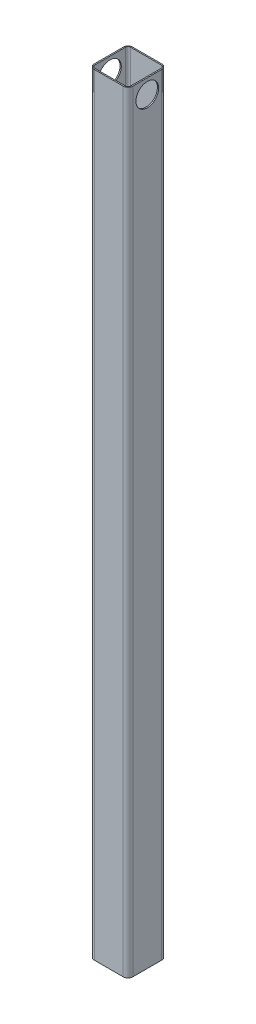
ISO-10303-21;
HEADER;
FILE_DESCRIPTION(('STEP AP214'),'2;1');
FILE_NAME('part.step','',(''),(''),'','','');
FILE_SCHEMA(('AUTOMOTIVE_DESIGN { 1 0 10303 214 1 1 1 1 }'));
ENDSEC;
DATA;
#1=APPLICATION_CONTEXT('core data for automotive mechanical design processes');
#2=APPLICATION_PROTOCOL_DEFINITION('international standard','automotive_design',2000,#1);
#3=PRODUCT_CONTEXT('',#1,'mechanical');
#4=PRODUCT('Part','Part','',(#3));
#5=PRODUCT_RELATED_PRODUCT_CATEGORY('part','',(#4));
#6=PRODUCT_DEFINITION_FORMATION('','',#4);
#7=PRODUCT_DEFINITION_CONTEXT('part definition',#1,'design');
#8=PRODUCT_DEFINITION('design','',#6,#7);
#9=PRODUCT_DEFINITION_SHAPE('','',#8);
#10=(LENGTH_UNIT() NAMED_UNIT(*) SI_UNIT(.MILLI.,.METRE.));
#11=(NAMED_UNIT(*) PLANE_ANGLE_UNIT() SI_UNIT($,.RADIAN.));
#12=(NAMED_UNIT(*) SI_UNIT($,.STERADIAN.) SOLID_ANGLE_UNIT());
#13=UNCERTAINTY_MEASURE_WITH_UNIT(LENGTH_MEASURE(1.E-05),#10,'distance_accuracy_value','');
#14=(GEOMETRIC_REPRESENTATION_CONTEXT(3) GLOBAL_UNCERTAINTY_ASSIGNED_CONTEXT((#13)) GLOBAL_UNIT_ASSIGNED_CONTEXT((#10,
#11,#12)) REPRESENTATION_CONTEXT('',''));
#15=CARTESIAN_POINT('',(0.,0.,0.));
#16=DIRECTION('',(0.,0.,1.));
#17=DIRECTION('',(1.,0.,0.));
#18=AXIS2_PLACEMENT_3D('',#15,#16,#17);
#19=CARTESIAN_POINT('',(28.575,762.,-28.575));
#20=DIRECTION('',(0.,1.,0.));
#21=DIRECTION('',(0.,0.,1.));
#22=AXIS2_PLACEMENT_3D('',#19,#20,#21);
#23=PLANE('',#22);
#24=CARTESIAN_POINT('',(28.575,762.,-28.575));
#25=DIRECTION('',(0.,1.,0.));
#26=DIRECTION('',(0.,0.,1.));
#27=AXIS2_PLACEMENT_3D('',#24,#25,#26);
#28=CIRCLE('',#27,9.525);
#29=CARTESIAN_POINT('',(38.1,762.,-28.575));
#30=VERTEX_POINT('',#29);
#31=CARTESIAN_POINT('',(28.575,762.,-38.1));
#32=VERTEX_POINT('',#31);
#33=EDGE_CURVE('E243',#30,#32,#28,.T.);
#34=ORIENTED_EDGE('',*,*,#33,.T.);
#35=DIRECTION('',(-1.,0.,0.));
#36=VECTOR('',#35,1.);
#37=CARTESIAN_POINT('',(28.575,762.,-38.1));
#38=LINE('',#37,#36);
#39=CARTESIAN_POINT('',(-28.575,762.,-38.1));
#40=VERTEX_POINT('',#39);
#41=EDGE_CURVE('E246',#32,#40,#38,.T.);
#42=ORIENTED_EDGE('',*,*,#41,.T.);
#43=CARTESIAN_POINT('',(-28.575,762.,-28.575));
#44=DIRECTION('',(0.,1.,0.));
#45=DIRECTION('',(0.,0.,1.));
#46=AXIS2_PLACEMENT_3D('',#43,#44,#45);
#47=CIRCLE('',#46,9.52499999999999);
#48=CARTESIAN_POINT('',(-38.1,762.,-28.575));
#49=VERTEX_POINT('',#48);
#50=EDGE_CURVE('E249',#40,#49,#47,.T.);
#51=ORIENTED_EDGE('',*,*,#50,.T.);
#52=DIRECTION('',(0.,0.,1.));
#53=VECTOR('',#52,1.);
#54=CARTESIAN_POINT('',(-38.1,762.,28.575));
#55=LINE('',#54,#53);
#56=CARTESIAN_POINT('',(-38.1,762.,28.575));
#57=VERTEX_POINT('',#56);
#58=EDGE_CURVE('E251',#49,#57,#55,.T.);
#59=ORIENTED_EDGE('',*,*,#58,.T.);
#60=CARTESIAN_POINT('',(-28.575,762.,28.575));
#61=DIRECTION('',(0.,1.,0.));
#62=DIRECTION('',(0.,0.,1.));
#63=AXIS2_PLACEMENT_3D('',#60,#61,#62);
#64=CIRCLE('',#63,9.525);
#65=CARTESIAN_POINT('',(-28.575,762.,38.1));
#66=VERTEX_POINT('',#65);
#67=EDGE_CURVE('E253',#57,#66,#64,.T.);
#68=ORIENTED_EDGE('',*,*,#67,.T.);
#69=DIRECTION('',(1.,0.,0.));
#70=VECTOR('',#69,1.);
#71=CARTESIAN_POINT('',(-28.575,762.,38.1));
#72=LINE('',#71,#70);
#73=CARTESIAN_POINT('',(28.575,762.,38.1));
#74=VERTEX_POINT('',#73);
#75=EDGE_CURVE('E256',#66,#74,#72,.T.);
#76=ORIENTED_EDGE('',*,*,#75,.T.);
#77=CARTESIAN_POINT('',(28.575,762.,28.575));
#78=DIRECTION('',(0.,1.,0.));
#79=DIRECTION('',(0.,0.,1.));
#80=AXIS2_PLACEMENT_3D('',#77,#78,#79);
#81=CIRCLE('',#80,9.525);
#82=CARTESIAN_POINT('',(38.1,762.,28.575));
#83=VERTEX_POINT('',#82);
#84=EDGE_CURVE('E259',#74,#83,#81,.T.);
#85=ORIENTED_EDGE('',*,*,#84,.T.);
#86=DIRECTION('',(0.,0.,-1.));
#87=VECTOR('',#86,1.);
#88=CARTESIAN_POINT('',(38.1,762.,-28.575));
#89=LINE('',#88,#87);
#90=EDGE_CURVE('E262',#83,#30,#89,.T.);
#91=ORIENTED_EDGE('',*,*,#90,.T.);
#92=EDGE_LOOP('',(#34,#42,#51,#59,#68,#76,#85,#91));
#93=FACE_BOUND('',#92,.T.);
#94=DIRECTION('',(0.,0.,1.));
#95=VECTOR('',#94,1.);
#96=CARTESIAN_POINT('',(-35.687,762.,30.9245));
#97=LINE('',#96,#95);
#98=CARTESIAN_POINT('',(-35.687,762.,-30.9245));
#99=VERTEX_POINT('',#98);
#100=CARTESIAN_POINT('',(-35.687,762.,30.9245));
#101=VERTEX_POINT('',#100);
#102=EDGE_CURVE('E170',#99,#101,#97,.T.);
#103=ORIENTED_EDGE('',*,*,#102,.F.);
#104=CARTESIAN_POINT('',(-30.9245,762.,-30.9245));
#105=DIRECTION('',(0.,1.,0.));
#106=DIRECTION('',(0.,0.,1.));
#107=AXIS2_PLACEMENT_3D('',#104,#105,#106);
#108=CIRCLE('',#107,4.7625);
#109=CARTESIAN_POINT('',(-30.9245,762.,-35.687));
#110=VERTEX_POINT('',#109);
#111=EDGE_CURVE('E162',#110,#99,#108,.T.);
#112=ORIENTED_EDGE('',*,*,#111,.F.);
#113=DIRECTION('',(-1.,0.,0.));
#114=VECTOR('',#113,1.);
#115=CARTESIAN_POINT('',(30.9245,762.,-35.687));
#116=LINE('',#115,#114);
#117=CARTESIAN_POINT('',(30.9245,762.,-35.687));
#118=VERTEX_POINT('',#117);
#119=EDGE_CURVE('E203',#118,#110,#116,.T.);
#120=ORIENTED_EDGE('',*,*,#119,.F.);
#121=CARTESIAN_POINT('',(30.9245,762.,-30.9245));
#122=DIRECTION('',(0.,1.,0.));
#123=DIRECTION('',(0.,0.,1.));
#124=AXIS2_PLACEMENT_3D('',#121,#122,#123);
#125=CIRCLE('',#124,4.7625);
#126=CARTESIAN_POINT('',(35.687,762.,-30.9245));
#127=VERTEX_POINT('',#126);
#128=EDGE_CURVE('E201',#127,#118,#125,.T.);
#129=ORIENTED_EDGE('',*,*,#128,.F.);
#130=DIRECTION('',(0.,0.,-1.));
#131=VECTOR('',#130,1.);
#132=CARTESIAN_POINT('',(35.687,762.,-30.9245));
#133=LINE('',#132,#131);
#134=CARTESIAN_POINT('',(35.687,762.,30.9245));
#135=VERTEX_POINT('',#134);
#136=EDGE_CURVE('E198',#135,#127,#133,.T.);
#137=ORIENTED_EDGE('',*,*,#136,.F.);
#138=CARTESIAN_POINT('',(30.9245,762.,30.9245));
#139=DIRECTION('',(0.,1.,0.));
#140=DIRECTION('',(0.,0.,1.));
#141=AXIS2_PLACEMENT_3D('',#138,#139,#140);
#142=CIRCLE('',#141,4.7625);
#143=CARTESIAN_POINT('',(30.9245,762.,35.687));
#144=VERTEX_POINT('',#143);
#145=EDGE_CURVE('E195',#144,#135,#142,.T.);
#146=ORIENTED_EDGE('',*,*,#145,.F.);
#147=DIRECTION('',(1.,0.,0.));
#148=VECTOR('',#147,1.);
#149=CARTESIAN_POINT('',(-30.9245,762.,35.687));
#150=LINE('',#149,#148);
#151=CARTESIAN_POINT('',(-30.9245,762.,35.687));
#152=VERTEX_POINT('',#151);
#153=EDGE_CURVE('E189',#152,#144,#150,.T.);
#154=ORIENTED_EDGE('',*,*,#153,.F.);
#155=CARTESIAN_POINT('',(-30.9245,762.,30.9245));
#156=DIRECTION('',(0.,1.,0.));
#157=DIRECTION('',(0.,0.,1.));
#158=AXIS2_PLACEMENT_3D('',#155,#156,#157);
#159=CIRCLE('',#158,4.7625);
#160=EDGE_CURVE('E184',#101,#152,#159,.T.);
#161=ORIENTED_EDGE('',*,*,#160,.F.);
#162=EDGE_LOOP('',(#103,#112,#120,#129,#137,#146,#154,#161));
#163=FACE_BOUND('',#162,.T.);
#164=ADVANCED_FACE('F39',(#93,#163),#23,.T.);
#165=CARTESIAN_POINT('',(28.575,-762.,-28.575));
#166=DIRECTION('',(0.,1.,0.));
#167=DIRECTION('',(0.,0.,1.));
#168=AXIS2_PLACEMENT_3D('',#165,#166,#167);
#169=PLANE('',#168);
#170=CARTESIAN_POINT('',(28.575,-762.,-28.575));
#171=DIRECTION('',(0.,1.,0.));
#172=DIRECTION('',(0.,0.,1.));
#173=AXIS2_PLACEMENT_3D('',#170,#171,#172);
#174=CIRCLE('',#173,9.525);
#175=CARTESIAN_POINT('',(38.1,-762.,-28.575));
#176=VERTEX_POINT('',#175);
#177=CARTESIAN_POINT('',(28.575,-762.,-38.1));
#178=VERTEX_POINT('',#177);
#179=EDGE_CURVE('E179',#176,#178,#174,.T.);
#180=ORIENTED_EDGE('',*,*,#179,.F.);
#181=DIRECTION('',(0.,0.,-1.));
#182=VECTOR('',#181,1.);
#183=CARTESIAN_POINT('',(38.1,-762.,-28.575));
#184=LINE('',#183,#182);
#185=CARTESIAN_POINT('',(38.1,-762.,28.575));
#186=VERTEX_POINT('',#185);
#187=EDGE_CURVE('E247',#186,#176,#184,.T.);
#188=ORIENTED_EDGE('',*,*,#187,.F.);
#189=CARTESIAN_POINT('',(28.575,-762.,28.575));
#190=DIRECTION('',(0.,1.,0.));
#191=DIRECTION('',(0.,0.,1.));
#192=AXIS2_PLACEMENT_3D('',#189,#190,#191);
#193=CIRCLE('',#192,9.525);
#194=CARTESIAN_POINT('',(28.575,-762.,38.1));
#195=VERTEX_POINT('',#194);
#196=EDGE_CURVE('E278',#195,#186,#193,.T.);
#197=ORIENTED_EDGE('',*,*,#196,.F.);
#198=DIRECTION('',(1.,0.,0.));
#199=VECTOR('',#198,1.);
#200=CARTESIAN_POINT('',(-28.575,-762.,38.1));
#201=LINE('',#200,#199);
#202=CARTESIAN_POINT('',(-28.575,-762.,38.1));
#203=VERTEX_POINT('',#202);
#204=EDGE_CURVE('E276',#203,#195,#201,.T.);
#205=ORIENTED_EDGE('',*,*,#204,.F.);
#206=CARTESIAN_POINT('',(-28.575,-762.,28.575));
#207=DIRECTION('',(0.,1.,0.));
#208=DIRECTION('',(0.,0.,1.));
#209=AXIS2_PLACEMENT_3D('',#206,#207,#208);
#210=CIRCLE('',#209,9.525);
#211=CARTESIAN_POINT('',(-38.1,-762.,28.575));
#212=VERTEX_POINT('',#211);
#213=EDGE_CURVE('E274',#212,#203,#210,.T.);
#214=ORIENTED_EDGE('',*,*,#213,.F.);
#215=DIRECTION('',(0.,0.,1.));
#216=VECTOR('',#215,1.);
#217=CARTESIAN_POINT('',(-38.1,-762.,28.575));
#218=LINE('',#217,#216);
#219=CARTESIAN_POINT('',(-38.1,-762.,-28.575));
#220=VERTEX_POINT('',#219);
#221=EDGE_CURVE('E272',#220,#212,#218,.T.);
#222=ORIENTED_EDGE('',*,*,#221,.F.);
#223=CARTESIAN_POINT('',(-28.575,-762.,-28.575));
#224=DIRECTION('',(0.,1.,0.));
#225=DIRECTION('',(0.,0.,1.));
#226=AXIS2_PLACEMENT_3D('',#223,#224,#225);
#227=CIRCLE('',#226,9.52499999999999);
#228=CARTESIAN_POINT('',(-28.575,-762.,-38.1));
#229=VERTEX_POINT('',#228);
#230=EDGE_CURVE('E270',#229,#220,#227,.T.);
#231=ORIENTED_EDGE('',*,*,#230,.F.);
#232=DIRECTION('',(-1.,0.,0.));
#233=VECTOR('',#232,1.);
#234=CARTESIAN_POINT('',(28.575,-762.,-38.1));
#235=LINE('',#234,#233);
#236=EDGE_CURVE('E268',#178,#229,#235,.T.);
#237=ORIENTED_EDGE('',*,*,#236,.F.);
#238=EDGE_LOOP('',(#180,#188,#197,#205,#214,#222,#231,#237));
#239=FACE_BOUND('',#238,.T.);
#240=CARTESIAN_POINT('',(-30.9245,-762.,-30.9245));
#241=DIRECTION('',(0.,1.,0.));
#242=DIRECTION('',(0.,0.,1.));
#243=AXIS2_PLACEMENT_3D('',#240,#241,#242);
#244=CIRCLE('',#243,4.7625);
#245=CARTESIAN_POINT('',(-30.9245,-762.,-35.687));
#246=VERTEX_POINT('',#245);
#247=CARTESIAN_POINT('',(-35.687,-762.,-30.9245));
#248=VERTEX_POINT('',#247);
#249=EDGE_CURVE('E64',#246,#248,#244,.T.);
#250=ORIENTED_EDGE('',*,*,#249,.T.);
#251=DIRECTION('',(0.,0.,1.));
#252=VECTOR('',#251,1.);
#253=CARTESIAN_POINT('',(-35.687,-762.,30.9245));
#254=LINE('',#253,#252);
#255=CARTESIAN_POINT('',(-35.687,-762.,30.9245));
#256=VERTEX_POINT('',#255);
#257=EDGE_CURVE('E177',#248,#256,#254,.T.);
#258=ORIENTED_EDGE('',*,*,#257,.T.);
#259=CARTESIAN_POINT('',(-30.9245,-762.,30.9245));
#260=DIRECTION('',(0.,1.,0.));
#261=DIRECTION('',(0.,0.,1.));
#262=AXIS2_PLACEMENT_3D('',#259,#260,#261);
#263=CIRCLE('',#262,4.7625);
#264=CARTESIAN_POINT('',(-30.9245,-762.,35.687));
#265=VERTEX_POINT('',#264);
#266=EDGE_CURVE('E208',#256,#265,#263,.T.);
#267=ORIENTED_EDGE('',*,*,#266,.T.);
#268=DIRECTION('',(1.,0.,0.));
#269=VECTOR('',#268,1.);
#270=CARTESIAN_POINT('',(-30.9245,-762.,35.687));
#271=LINE('',#270,#269);
#272=CARTESIAN_POINT('',(30.9245,-762.,35.687));
#273=VERTEX_POINT('',#272);
#274=EDGE_CURVE('E211',#265,#273,#271,.T.);
#275=ORIENTED_EDGE('',*,*,#274,.T.);
#276=CARTESIAN_POINT('',(30.9245,-762.,30.9245));
#277=DIRECTION('',(0.,1.,0.));
#278=DIRECTION('',(0.,0.,1.));
#279=AXIS2_PLACEMENT_3D('',#276,#277,#278);
#280=CIRCLE('',#279,4.7625);
#281=CARTESIAN_POINT('',(35.687,-762.,30.9245));
#282=VERTEX_POINT('',#281);
#283=EDGE_CURVE('E214',#273,#282,#280,.T.);
#284=ORIENTED_EDGE('',*,*,#283,.T.);
#285=DIRECTION('',(0.,0.,-1.));
#286=VECTOR('',#285,1.);
#287=CARTESIAN_POINT('',(35.687,-762.,-30.9245));
#288=LINE('',#287,#286);
#289=CARTESIAN_POINT('',(35.687,-762.,-30.9245));
#290=VERTEX_POINT('',#289);
#291=EDGE_CURVE('E217',#282,#290,#288,.T.);
#292=ORIENTED_EDGE('',*,*,#291,.T.);
#293=CARTESIAN_POINT('',(30.9245,-762.,-30.9245));
#294=DIRECTION('',(0.,1.,0.));
#295=DIRECTION('',(0.,0.,1.));
#296=AXIS2_PLACEMENT_3D('',#293,#294,#295);
#297=CIRCLE('',#296,4.7625);
#298=CARTESIAN_POINT('',(30.9245,-762.,-35.687));
#299=VERTEX_POINT('',#298);
#300=EDGE_CURVE('E220',#290,#299,#297,.T.);
#301=ORIENTED_EDGE('',*,*,#300,.T.);
#302=DIRECTION('',(-1.,0.,0.));
#303=VECTOR('',#302,1.);
#304=CARTESIAN_POINT('',(30.9245,-762.,-35.687));
#305=LINE('',#304,#303);
#306=EDGE_CURVE('E171',#299,#246,#305,.T.);
#307=ORIENTED_EDGE('',*,*,#306,.T.);
#308=EDGE_LOOP('',(#250,#258,#267,#275,#284,#292,#301,#307));
#309=FACE_BOUND('',#308,.T.);
#310=ADVANCED_FACE('F317',(#239,#309),#169,.F.);
#311=CARTESIAN_POINT('',(28.575,762.,-28.575));
#312=DIRECTION('',(0.,-1.,0.));
#313=DIRECTION('',(0.,0.,-1.));
#314=AXIS2_PLACEMENT_3D('',#311,#312,#313);
#315=CYLINDRICAL_SURFACE('',#314,9.525);
#316=ORIENTED_EDGE('',*,*,#179,.T.);
#317=DIRECTION('',(0.,-1.,0.));
#318=VECTOR('',#317,1.);
#319=CARTESIAN_POINT('',(28.575,762.,-38.1));
#320=LINE('',#319,#318);
#321=EDGE_CURVE('E11',#32,#178,#320,.T.);
#322=ORIENTED_EDGE('',*,*,#321,.F.);
#323=ORIENTED_EDGE('',*,*,#33,.F.);
#324=DIRECTION('',(0.,-1.,0.));
#325=VECTOR('',#324,1.);
#326=CARTESIAN_POINT('',(38.1,762.,-28.575));
#327=LINE('',#326,#325);
#328=EDGE_CURVE('E265',#30,#176,#327,.T.);
#329=ORIENTED_EDGE('',*,*,#328,.T.);
#330=EDGE_LOOP('',(#316,#322,#323,#329));
#331=FACE_BOUND('',#330,.T.);
#332=ADVANCED_FACE('F41',(#331),#315,.T.);
#333=CARTESIAN_POINT('',(28.575,762.,-38.1));
#334=DIRECTION('',(0.,0.,1.));
#335=DIRECTION('',(1.,0.,0.));
#336=AXIS2_PLACEMENT_3D('',#333,#334,#335);
#337=PLANE('',#336);
#338=ORIENTED_EDGE('',*,*,#236,.T.);
#339=DIRECTION('',(0.,-1.,0.));
#340=VECTOR('',#339,1.);
#341=CARTESIAN_POINT('',(-28.575,762.,-38.1));
#342=LINE('',#341,#340);
#343=EDGE_CURVE('E49',#40,#229,#342,.T.);
#344=ORIENTED_EDGE('',*,*,#343,.F.);
#345=ORIENTED_EDGE('',*,*,#41,.F.);
#346=ORIENTED_EDGE('',*,*,#321,.T.);
#347=EDGE_LOOP('',(#338,#344,#345,#346));
#348=FACE_BOUND('',#347,.T.);
#349=ADVANCED_FACE('F334',(#348),#337,.F.);
#350=CARTESIAN_POINT('',(-28.575,762.,-28.575));
#351=DIRECTION('',(0.,-1.,0.));
#352=DIRECTION('',(0.,0.,-1.));
#353=AXIS2_PLACEMENT_3D('',#350,#351,#352);
#354=CYLINDRICAL_SURFACE('',#353,9.52499999999999);
#355=ORIENTED_EDGE('',*,*,#230,.T.);
#356=DIRECTION('',(0.,-1.,0.));
#357=VECTOR('',#356,1.);
#358=CARTESIAN_POINT('',(-38.1,762.,-28.575));
#359=LINE('',#358,#357);
#360=EDGE_CURVE('E300',#49,#220,#359,.T.);
#361=ORIENTED_EDGE('',*,*,#360,.F.);
#362=ORIENTED_EDGE('',*,*,#50,.F.);
#363=ORIENTED_EDGE('',*,*,#343,.T.);
#364=EDGE_LOOP('',(#355,#361,#362,#363));
#365=FACE_BOUND('',#364,.T.);
#366=ADVANCED_FACE('F311',(#365),#354,.T.);
#367=CARTESIAN_POINT('',(-38.1,762.,28.575));
#368=DIRECTION('',(1.,0.,0.));
#369=DIRECTION('',(0.,0.,-1.));
#370=AXIS2_PLACEMENT_3D('',#367,#368,#369);
#371=PLANE('',#370);
#372=CARTESIAN_POINT('',(-38.1,733.171,0.));
#373=DIRECTION('',(1.,0.,0.));
#374=DIRECTION('',(0.,0.,-1.));
#375=AXIS2_PLACEMENT_3D('',#372,#373,#374);
#376=CIRCLE('',#375,22.479);
#377=CARTESIAN_POINT('',(-38.1,733.171,-22.479));
#378=VERTEX_POINT('',#377);
#379=EDGE_CURVE('E375',#378,#378,#376,.T.);
#380=ORIENTED_EDGE('',*,*,#379,.T.);
#381=EDGE_LOOP('',(#380));
#382=FACE_BOUND('',#381,.T.);
#383=ORIENTED_EDGE('',*,*,#221,.T.);
#384=DIRECTION('',(0.,-1.,0.));
#385=VECTOR('',#384,1.);
#386=CARTESIAN_POINT('',(-38.1,762.,28.575));
#387=LINE('',#386,#385);
#388=EDGE_CURVE('E296',#57,#212,#387,.T.);
#389=ORIENTED_EDGE('',*,*,#388,.F.);
#390=ORIENTED_EDGE('',*,*,#58,.F.);
#391=ORIENTED_EDGE('',*,*,#360,.T.);
#392=EDGE_LOOP('',(#383,#389,#390,#391));
#393=FACE_BOUND('',#392,.T.);
#394=ADVANCED_FACE('F323',(#382,#393),#371,.F.);
#395=CARTESIAN_POINT('',(-28.575,762.,28.575));
#396=DIRECTION('',(0.,-1.,0.));
#397=DIRECTION('',(0.,0.,-1.));
#398=AXIS2_PLACEMENT_3D('',#395,#396,#397);
#399=CYLINDRICAL_SURFACE('',#398,9.525);
#400=ORIENTED_EDGE('',*,*,#213,.T.);
#401=DIRECTION('',(0.,-1.,0.));
#402=VECTOR('',#401,1.);
#403=CARTESIAN_POINT('',(-28.575,762.,38.1));
#404=LINE('',#403,#402);
#405=EDGE_CURVE('E292',#66,#203,#404,.T.);
#406=ORIENTED_EDGE('',*,*,#405,.F.);
#407=ORIENTED_EDGE('',*,*,#67,.F.);
#408=ORIENTED_EDGE('',*,*,#388,.T.);
#409=EDGE_LOOP('',(#400,#406,#407,#408));
#410=FACE_BOUND('',#409,.T.);
#411=ADVANCED_FACE('F327',(#410),#399,.T.);
#412=CARTESIAN_POINT('',(-28.575,762.,38.1));
#413=DIRECTION('',(0.,0.,-1.));
#414=DIRECTION('',(-1.,0.,0.));
#415=AXIS2_PLACEMENT_3D('',#412,#413,#414);
#416=PLANE('',#415);
#417=ORIENTED_EDGE('',*,*,#204,.T.);
#418=DIRECTION('',(0.,-1.,0.));
#419=VECTOR('',#418,1.);
#420=CARTESIAN_POINT('',(28.575,762.,38.1));
#421=LINE('',#420,#419);
#422=EDGE_CURVE('E288',#74,#195,#421,.T.);
#423=ORIENTED_EDGE('',*,*,#422,.F.);
#424=ORIENTED_EDGE('',*,*,#75,.F.);
#425=ORIENTED_EDGE('',*,*,#405,.T.);
#426=EDGE_LOOP('',(#417,#423,#424,#425));
#427=FACE_BOUND('',#426,.T.);
#428=ADVANCED_FACE('F347',(#427),#416,.F.);
#429=CARTESIAN_POINT('',(28.575,762.,28.575));
#430=DIRECTION('',(0.,-1.,0.));
#431=DIRECTION('',(0.,0.,-1.));
#432=AXIS2_PLACEMENT_3D('',#429,#430,#431);
#433=CYLINDRICAL_SURFACE('',#432,9.525);
#434=ORIENTED_EDGE('',*,*,#196,.T.);
#435=DIRECTION('',(0.,-1.,0.));
#436=VECTOR('',#435,1.);
#437=CARTESIAN_POINT('',(38.1,762.,28.575));
#438=LINE('',#437,#436);
#439=EDGE_CURVE('E284',#83,#186,#438,.T.);
#440=ORIENTED_EDGE('',*,*,#439,.F.);
#441=ORIENTED_EDGE('',*,*,#84,.F.);
#442=ORIENTED_EDGE('',*,*,#422,.T.);
#443=EDGE_LOOP('',(#434,#440,#441,#442));
#444=FACE_BOUND('',#443,.T.);
#445=ADVANCED_FACE('F345',(#444),#433,.T.);
#446=CARTESIAN_POINT('',(38.1,762.,-28.575));
#447=DIRECTION('',(-1.,0.,0.));
#448=DIRECTION('',(0.,0.,1.));
#449=AXIS2_PLACEMENT_3D('',#446,#447,#448);
#450=PLANE('',#449);
#451=CARTESIAN_POINT('',(38.1,733.171,0.));
#452=DIRECTION('',(1.,0.,0.));
#453=DIRECTION('',(0.,0.,-1.));
#454=AXIS2_PLACEMENT_3D('',#451,#452,#453);
#455=CIRCLE('',#454,22.479);
#456=CARTESIAN_POINT('',(38.1,733.171,-22.479));
#457=VERTEX_POINT('',#456);
#458=EDGE_CURVE('E372',#457,#457,#455,.T.);
#459=ORIENTED_EDGE('',*,*,#458,.F.);
#460=EDGE_LOOP('',(#459));
#461=FACE_BOUND('',#460,.T.);
#462=ORIENTED_EDGE('',*,*,#187,.T.);
#463=ORIENTED_EDGE('',*,*,#328,.F.);
#464=ORIENTED_EDGE('',*,*,#90,.F.);
#465=ORIENTED_EDGE('',*,*,#439,.T.);
#466=EDGE_LOOP('',(#462,#463,#464,#465));
#467=FACE_BOUND('',#466,.T.);
#468=ADVANCED_FACE('F340',(#461,#467),#450,.F.);
#469=CARTESIAN_POINT('',(-30.9245,762.,-30.9245));
#470=DIRECTION('',(0.,-1.,0.));
#471=DIRECTION('',(0.,0.,-1.));
#472=AXIS2_PLACEMENT_3D('',#469,#470,#471);
#473=CYLINDRICAL_SURFACE('',#472,4.7625);
#474=ORIENTED_EDGE('',*,*,#249,.F.);
#475=DIRECTION('',(0.,-1.,0.));
#476=VECTOR('',#475,1.);
#477=CARTESIAN_POINT('',(-30.9245,762.,-35.687));
#478=LINE('',#477,#476);
#479=EDGE_CURVE('E166',#110,#246,#478,.T.);
#480=ORIENTED_EDGE('',*,*,#479,.F.);
#481=ORIENTED_EDGE('',*,*,#111,.T.);
#482=DIRECTION('',(0.,-1.,0.));
#483=VECTOR('',#482,1.);
#484=CARTESIAN_POINT('',(-35.687,762.,-30.9245));
#485=LINE('',#484,#483);
#486=EDGE_CURVE('E165',#99,#248,#485,.T.);
#487=ORIENTED_EDGE('',*,*,#486,.T.);
#488=EDGE_LOOP('',(#474,#480,#481,#487));
#489=FACE_BOUND('',#488,.T.);
#490=ADVANCED_FACE('F164',(#489),#473,.F.);
#491=CARTESIAN_POINT('',(-35.687,762.,30.9245));
#492=DIRECTION('',(1.,0.,0.));
#493=DIRECTION('',(0.,0.,-1.));
#494=AXIS2_PLACEMENT_3D('',#491,#492,#493);
#495=PLANE('',#494);
#496=CARTESIAN_POINT('',(-35.687,733.171,0.));
#497=DIRECTION('',(1.,0.,0.));
#498=DIRECTION('',(0.,0.,-1.));
#499=AXIS2_PLACEMENT_3D('',#496,#497,#498);
#500=CIRCLE('',#499,22.479);
#501=CARTESIAN_POINT('',(-35.687,733.171,-22.479));
#502=VERTEX_POINT('',#501);
#503=EDGE_CURVE('E206',#502,#502,#500,.T.);
#504=ORIENTED_EDGE('',*,*,#503,.F.);
#505=EDGE_LOOP('',(#504));
#506=FACE_BOUND('',#505,.T.);
#507=ORIENTED_EDGE('',*,*,#257,.F.);
#508=ORIENTED_EDGE('',*,*,#486,.F.);
#509=ORIENTED_EDGE('',*,*,#102,.T.);
#510=DIRECTION('',(0.,-1.,0.));
#511=VECTOR('',#510,1.);
#512=CARTESIAN_POINT('',(-35.687,762.,30.9245));
#513=LINE('',#512,#511);
#514=EDGE_CURVE('E180',#101,#256,#513,.T.);
#515=ORIENTED_EDGE('',*,*,#514,.T.);
#516=EDGE_LOOP('',(#507,#508,#509,#515));
#517=FACE_BOUND('',#516,.T.);
#518=ADVANCED_FACE('F174',(#506,#517),#495,.T.);
#519=CARTESIAN_POINT('',(-30.9245,762.,30.9245));
#520=DIRECTION('',(0.,-1.,0.));
#521=DIRECTION('',(0.,0.,-1.));
#522=AXIS2_PLACEMENT_3D('',#519,#520,#521);
#523=CYLINDRICAL_SURFACE('',#522,4.7625);
#524=ORIENTED_EDGE('',*,*,#266,.F.);
#525=ORIENTED_EDGE('',*,*,#514,.F.);
#526=ORIENTED_EDGE('',*,*,#160,.T.);
#527=DIRECTION('',(0.,-1.,0.));
#528=VECTOR('',#527,1.);
#529=CARTESIAN_POINT('',(-30.9245,762.,35.687));
#530=LINE('',#529,#528);
#531=EDGE_CURVE('E238',#152,#265,#530,.T.);
#532=ORIENTED_EDGE('',*,*,#531,.T.);
#533=EDGE_LOOP('',(#524,#525,#526,#532));
#534=FACE_BOUND('',#533,.T.);
#535=ADVANCED_FACE('F423',(#534),#523,.F.);
#536=CARTESIAN_POINT('',(-30.9245,762.,35.687));
#537=DIRECTION('',(0.,0.,-1.));
#538=DIRECTION('',(-1.,0.,0.));
#539=AXIS2_PLACEMENT_3D('',#536,#537,#538);
#540=PLANE('',#539);
#541=ORIENTED_EDGE('',*,*,#274,.F.);
#542=ORIENTED_EDGE('',*,*,#531,.F.);
#543=ORIENTED_EDGE('',*,*,#153,.T.);
#544=DIRECTION('',(0.,-1.,0.));
#545=VECTOR('',#544,1.);
#546=CARTESIAN_POINT('',(30.9245,762.,35.687));
#547=LINE('',#546,#545);
#548=EDGE_CURVE('E235',#144,#273,#547,.T.);
#549=ORIENTED_EDGE('',*,*,#548,.T.);
#550=EDGE_LOOP('',(#541,#542,#543,#549));
#551=FACE_BOUND('',#550,.T.);
#552=ADVANCED_FACE('F420',(#551),#540,.T.);
#553=CARTESIAN_POINT('',(30.9245,762.,30.9245));
#554=DIRECTION('',(0.,-1.,0.));
#555=DIRECTION('',(0.,0.,-1.));
#556=AXIS2_PLACEMENT_3D('',#553,#554,#555);
#557=CYLINDRICAL_SURFACE('',#556,4.7625);
#558=ORIENTED_EDGE('',*,*,#283,.F.);
#559=ORIENTED_EDGE('',*,*,#548,.F.);
#560=ORIENTED_EDGE('',*,*,#145,.T.);
#561=DIRECTION('',(0.,-1.,0.));
#562=VECTOR('',#561,1.);
#563=CARTESIAN_POINT('',(35.687,762.,30.9245));
#564=LINE('',#563,#562);
#565=EDGE_CURVE('E232',#135,#282,#564,.T.);
#566=ORIENTED_EDGE('',*,*,#565,.T.);
#567=EDGE_LOOP('',(#558,#559,#560,#566));
#568=FACE_BOUND('',#567,.T.);
#569=ADVANCED_FACE('F393',(#568),#557,.F.);
#570=CARTESIAN_POINT('',(35.687,762.,-30.9245));
#571=DIRECTION('',(-1.,0.,0.));
#572=DIRECTION('',(0.,0.,1.));
#573=AXIS2_PLACEMENT_3D('',#570,#571,#572);
#574=PLANE('',#573);
#575=CARTESIAN_POINT('',(35.687,733.171,0.));
#576=DIRECTION('',(-1.,0.,0.));
#577=DIRECTION('',(0.,0.,1.));
#578=AXIS2_PLACEMENT_3D('',#575,#576,#577);
#579=CIRCLE('',#578,22.479);
#580=CARTESIAN_POINT('',(35.687,733.171,22.479));
#581=VERTEX_POINT('',#580);
#582=EDGE_CURVE('E43',#581,#581,#579,.T.);
#583=ORIENTED_EDGE('',*,*,#582,.F.);
#584=EDGE_LOOP('',(#583));
#585=FACE_BOUND('',#584,.T.);
#586=ORIENTED_EDGE('',*,*,#291,.F.);
#587=ORIENTED_EDGE('',*,*,#565,.F.);
#588=ORIENTED_EDGE('',*,*,#136,.T.);
#589=DIRECTION('',(0.,-1.,0.));
#590=VECTOR('',#589,1.);
#591=CARTESIAN_POINT('',(35.687,762.,-30.9245));
#592=LINE('',#591,#590);
#593=EDGE_CURVE('E229',#127,#290,#592,.T.);
#594=ORIENTED_EDGE('',*,*,#593,.T.);
#595=EDGE_LOOP('',(#586,#587,#588,#594));
#596=FACE_BOUND('',#595,.T.);
#597=ADVANCED_FACE('F389',(#585,#596),#574,.T.);
#598=CARTESIAN_POINT('',(30.9245,762.,-30.9245));
#599=DIRECTION('',(0.,-1.,0.));
#600=DIRECTION('',(0.,0.,-1.));
#601=AXIS2_PLACEMENT_3D('',#598,#599,#600);
#602=CYLINDRICAL_SURFACE('',#601,4.7625);
#603=ORIENTED_EDGE('',*,*,#300,.F.);
#604=ORIENTED_EDGE('',*,*,#593,.F.);
#605=ORIENTED_EDGE('',*,*,#128,.T.);
#606=DIRECTION('',(0.,-1.,0.));
#607=VECTOR('',#606,1.);
#608=CARTESIAN_POINT('',(30.9245,762.,-35.687));
#609=LINE('',#608,#607);
#610=EDGE_CURVE('E56',#118,#299,#609,.T.);
#611=ORIENTED_EDGE('',*,*,#610,.T.);
#612=EDGE_LOOP('',(#603,#604,#605,#611));
#613=FACE_BOUND('',#612,.T.);
#614=ADVANCED_FACE('F392',(#613),#602,.F.);
#615=CARTESIAN_POINT('',(30.9245,762.,-35.687));
#616=DIRECTION('',(0.,0.,1.));
#617=DIRECTION('',(1.,0.,0.));
#618=AXIS2_PLACEMENT_3D('',#615,#616,#617);
#619=PLANE('',#618);
#620=ORIENTED_EDGE('',*,*,#306,.F.);
#621=ORIENTED_EDGE('',*,*,#610,.F.);
#622=ORIENTED_EDGE('',*,*,#119,.T.);
#623=ORIENTED_EDGE('',*,*,#479,.T.);
#624=EDGE_LOOP('',(#620,#621,#622,#623));
#625=FACE_BOUND('',#624,.T.);
#626=ADVANCED_FACE('F407',(#625),#619,.T.);
#627=CARTESIAN_POINT('',(-38.1,733.171,0.));
#628=DIRECTION('',(1.,0.,0.));
#629=DIRECTION('',(0.,0.,-1.));
#630=AXIS2_PLACEMENT_3D('',#627,#628,#629);
#631=CYLINDRICAL_SURFACE('',#630,22.479);
#632=ORIENTED_EDGE('',*,*,#582,.T.);
#633=EDGE_LOOP('',(#632));
#634=FACE_BOUND('',#633,.T.);
#635=ORIENTED_EDGE('',*,*,#458,.T.);
#636=EDGE_LOOP('',(#635));
#637=FACE_BOUND('',#636,.T.);
#638=ADVANCED_FACE('F387',(#634,#637),#631,.F.);
#639=ORIENTED_EDGE('',*,*,#503,.T.);
#640=EDGE_LOOP('',(#639));
#641=FACE_BOUND('',#640,.T.);
#642=ORIENTED_EDGE('',*,*,#379,.F.);
#643=EDGE_LOOP('',(#642));
#644=FACE_BOUND('',#643,.T.);
#645=ADVANCED_FACE('F414',(#641,#644),#631,.F.);
#646=CLOSED_SHELL('',(#164,#310,#332,#349,#366,#394,#411,#428,#445,#468,#490,#518,#535,#552,
#569,#597,#614,#626,#638,#645));
#647=MANIFOLD_SOLID_BREP('B2',#646);
#648=ADVANCED_BREP_SHAPE_REPRESENTATION('',(#18,#647),#14);
#649=SHAPE_DEFINITION_REPRESENTATION(#9,#648);
ENDSEC;
END-ISO-10303-21;
